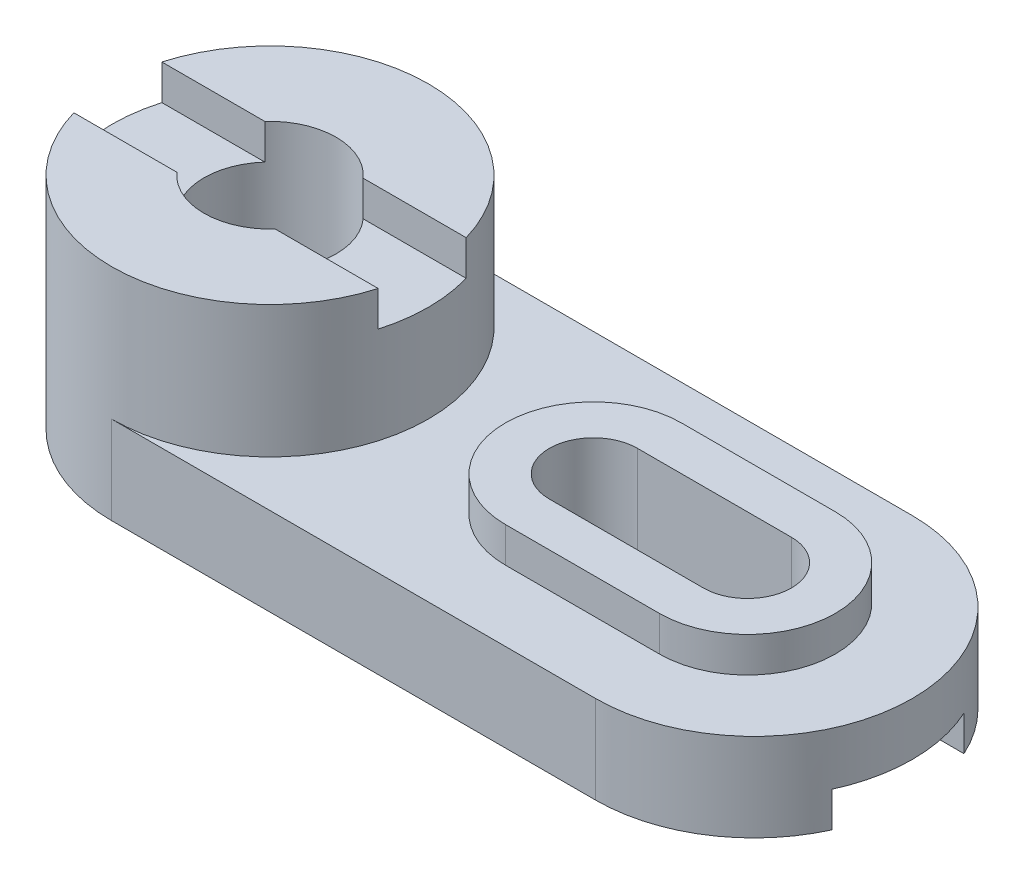
ISO-10303-21;
HEADER;
FILE_DESCRIPTION(('STEP AP214'),'2;1');
FILE_NAME('part.step','',(''),(''),'','','');
FILE_SCHEMA(('AUTOMOTIVE_DESIGN { 1 0 10303 214 1 1 1 1 }'));
ENDSEC;
DATA;
#1=APPLICATION_CONTEXT('core data for automotive mechanical design processes');
#2=APPLICATION_PROTOCOL_DEFINITION('international standard','automotive_design',2000,#1);
#3=PRODUCT_CONTEXT('',#1,'mechanical');
#4=PRODUCT('Part','Part','',(#3));
#5=PRODUCT_RELATED_PRODUCT_CATEGORY('part','',(#4));
#6=PRODUCT_DEFINITION_FORMATION('','',#4);
#7=PRODUCT_DEFINITION_CONTEXT('part definition',#1,'design');
#8=PRODUCT_DEFINITION('design','',#6,#7);
#9=PRODUCT_DEFINITION_SHAPE('','',#8);
#10=(LENGTH_UNIT() NAMED_UNIT(*) SI_UNIT(.MILLI.,.METRE.));
#11=(NAMED_UNIT(*) PLANE_ANGLE_UNIT() SI_UNIT($,.RADIAN.));
#12=(NAMED_UNIT(*) SI_UNIT($,.STERADIAN.) SOLID_ANGLE_UNIT());
#13=UNCERTAINTY_MEASURE_WITH_UNIT(LENGTH_MEASURE(1.E-05),#10,'distance_accuracy_value','');
#14=(GEOMETRIC_REPRESENTATION_CONTEXT(3) GLOBAL_UNCERTAINTY_ASSIGNED_CONTEXT((#13)) GLOBAL_UNIT_ASSIGNED_CONTEXT((#10,
#11,#12)) REPRESENTATION_CONTEXT('',''));
#15=CARTESIAN_POINT('',(0.,0.,0.));
#16=DIRECTION('',(0.,0.,1.));
#17=DIRECTION('',(1.,0.,0.));
#18=AXIS2_PLACEMENT_3D('',#15,#16,#17);
#19=CARTESIAN_POINT('',(18.5,28.,0.));
#20=DIRECTION('',(0.,1.,0.));
#21=DIRECTION('',(0.,0.,1.));
#22=AXIS2_PLACEMENT_3D('',#19,#20,#21);
#23=PLANE('',#22);
#24=CARTESIAN_POINT('',(18.5,28.,0.));
#25=DIRECTION('',(0.,1.,0.));
#26=DIRECTION('',(0.,0.,1.));
#27=AXIS2_PLACEMENT_3D('',#24,#25,#26);
#28=CIRCLE('',#27,20.);
#29=CARTESIAN_POINT('',(18.5,28.,-20.));
#30=VERTEX_POINT('',#29);
#31=CARTESIAN_POINT('',(18.5,28.,20.));
#32=VERTEX_POINT('',#31);
#33=EDGE_CURVE('E338',#30,#32,#28,.T.);
#34=ORIENTED_EDGE('',*,*,#33,.T.);
#35=DIRECTION('',(1.,0.,0.));
#36=VECTOR('',#35,1.);
#37=CARTESIAN_POINT('',(18.5,28.,20.));
#38=LINE('',#37,#36);
#39=CARTESIAN_POINT('',(53.5,28.,20.));
#40=VERTEX_POINT('',#39);
#41=EDGE_CURVE('E341',#32,#40,#38,.T.);
#42=ORIENTED_EDGE('',*,*,#41,.T.);
#43=CARTESIAN_POINT('',(53.5,28.,0.));
#44=DIRECTION('',(0.,1.,0.));
#45=DIRECTION('',(0.,0.,1.));
#46=AXIS2_PLACEMENT_3D('',#43,#44,#45);
#47=CIRCLE('',#46,20.);
#48=CARTESIAN_POINT('',(53.5,28.,-20.));
#49=VERTEX_POINT('',#48);
#50=EDGE_CURVE('E344',#40,#49,#47,.T.);
#51=ORIENTED_EDGE('',*,*,#50,.T.);
#52=DIRECTION('',(-1.,0.,0.));
#53=VECTOR('',#52,1.);
#54=CARTESIAN_POINT('',(18.5,28.,-20.));
#55=LINE('',#54,#53);
#56=EDGE_CURVE('E346',#49,#30,#55,.T.);
#57=ORIENTED_EDGE('',*,*,#56,.T.);
#58=EDGE_LOOP('',(#34,#42,#51,#57));
#59=FACE_BOUND('',#58,.T.);
#60=DIRECTION('',(-1.,0.,0.));
#61=VECTOR('',#60,1.);
#62=CARTESIAN_POINT('',(18.5,28.,10.));
#63=LINE('',#62,#61);
#64=CARTESIAN_POINT('',(53.5,28.,10.));
#65=VERTEX_POINT('',#64);
#66=CARTESIAN_POINT('',(18.5,28.,10.));
#67=VERTEX_POINT('',#66);
#68=EDGE_CURVE('E294',#65,#67,#63,.T.);
#69=ORIENTED_EDGE('',*,*,#68,.T.);
#70=CARTESIAN_POINT('',(18.5,28.,0.));
#71=DIRECTION('',(0.,1.,0.));
#72=DIRECTION('',(0.,0.,1.));
#73=AXIS2_PLACEMENT_3D('',#70,#71,#72);
#74=CIRCLE('',#73,10.);
#75=CARTESIAN_POINT('',(18.5,28.,-10.));
#76=VERTEX_POINT('',#75);
#77=EDGE_CURVE('E267',#67,#76,#74,.F.);
#78=ORIENTED_EDGE('',*,*,#77,.T.);
#79=DIRECTION('',(1.,0.,0.));
#80=VECTOR('',#79,1.);
#81=CARTESIAN_POINT('',(18.5,28.,-10.));
#82=LINE('',#81,#80);
#83=CARTESIAN_POINT('',(53.5,28.,-10.));
#84=VERTEX_POINT('',#83);
#85=EDGE_CURVE('E221',#76,#84,#82,.T.);
#86=ORIENTED_EDGE('',*,*,#85,.T.);
#87=CARTESIAN_POINT('',(53.5,28.,0.));
#88=DIRECTION('',(0.,1.,0.));
#89=DIRECTION('',(0.,0.,1.));
#90=AXIS2_PLACEMENT_3D('',#87,#88,#89);
#91=CIRCLE('',#90,10.);
#92=EDGE_CURVE('E276',#84,#65,#91,.F.);
#93=ORIENTED_EDGE('',*,*,#92,.T.);
#94=EDGE_LOOP('',(#69,#78,#86,#93));
#95=FACE_BOUND('',#94,.T.);
#96=ADVANCED_FACE('F36',(#59,#95),#23,.T.);
#97=CARTESIAN_POINT('',(-91.,42.,10.));
#98=DIRECTION('',(0.,-1.,0.));
#99=DIRECTION('',(0.,0.,-1.));
#100=AXIS2_PLACEMENT_3D('',#97,#98,#99);
#101=PLANE('',#100);
#102=CARTESIAN_POINT('',(-55.,42.,0.));
#103=DIRECTION('',(0.,-1.,0.));
#104=DIRECTION('',(0.,0.,-1.));
#105=AXIS2_PLACEMENT_3D('',#102,#103,#104);
#106=CIRCLE('',#105,15.);
#107=CARTESIAN_POINT('',(-66.1803398874989,42.,-10.));
#108=VERTEX_POINT('',#107);
#109=CARTESIAN_POINT('',(-66.180339887499,42.,10.));
#110=VERTEX_POINT('',#109);
#111=EDGE_CURVE('E287',#108,#110,#106,.F.);
#112=ORIENTED_EDGE('',*,*,#111,.F.);
#113=DIRECTION('',(1.,0.,0.));
#114=VECTOR('',#113,1.);
#115=CARTESIAN_POINT('',(-91.,42.,-10.));
#116=LINE('',#115,#114);
#117=CARTESIAN_POINT('',(-89.5832329315812,42.,-10.));
#118=VERTEX_POINT('',#117);
#119=EDGE_CURVE('E306',#118,#108,#116,.T.);
#120=ORIENTED_EDGE('',*,*,#119,.F.);
#121=CARTESIAN_POINT('',(-55.,42.,0.));
#122=DIRECTION('',(0.,-1.,0.));
#123=DIRECTION('',(0.,0.,-1.));
#124=AXIS2_PLACEMENT_3D('',#121,#122,#123);
#125=CIRCLE('',#124,36.);
#126=CARTESIAN_POINT('',(-89.5832329315812,42.,10.));
#127=VERTEX_POINT('',#126);
#128=EDGE_CURVE('E243',#127,#118,#125,.T.);
#129=ORIENTED_EDGE('',*,*,#128,.F.);
#130=DIRECTION('',(1.,0.,0.));
#131=VECTOR('',#130,1.);
#132=CARTESIAN_POINT('',(-91.,42.,10.));
#133=LINE('',#132,#131);
#134=EDGE_CURVE('E310',#127,#110,#133,.T.);
#135=ORIENTED_EDGE('',*,*,#134,.T.);
#136=EDGE_LOOP('',(#112,#120,#129,#135));
#137=FACE_BOUND('',#136,.T.);
#138=ADVANCED_FACE('F464',(#137),#101,.F.);
#139=CARTESIAN_POINT('',(-91.,50.,10.));
#140=DIRECTION('',(0.,0.,1.));
#141=DIRECTION('',(0.,-1.,0.));
#142=AXIS2_PLACEMENT_3D('',#139,#140,#141);
#143=PLANE('',#142);
#144=DIRECTION('',(0.,-1.,0.));
#145=VECTOR('',#144,1.);
#146=CARTESIAN_POINT('',(-66.180339887499,50.,10.));
#147=LINE('',#146,#145);
#148=CARTESIAN_POINT('',(-66.180339887499,50.,10.));
#149=VERTEX_POINT('',#148);
#150=EDGE_CURVE('E207',#110,#149,#147,.F.);
#151=ORIENTED_EDGE('',*,*,#150,.F.);
#152=ORIENTED_EDGE('',*,*,#134,.F.);
#153=DIRECTION('',(0.,-1.,0.));
#154=VECTOR('',#153,1.);
#155=CARTESIAN_POINT('',(-89.5832329315812,20.,9.99999999999999));
#156=LINE('',#155,#154);
#157=CARTESIAN_POINT('',(-89.5832329315811,50.,10.));
#158=VERTEX_POINT('',#157);
#159=EDGE_CURVE('E320',#158,#127,#156,.T.);
#160=ORIENTED_EDGE('',*,*,#159,.F.);
#161=DIRECTION('',(1.,0.,0.));
#162=VECTOR('',#161,1.);
#163=CARTESIAN_POINT('',(-55.,50.,10.));
#164=LINE('',#163,#162);
#165=EDGE_CURVE('E228',#158,#149,#164,.T.);
#166=ORIENTED_EDGE('',*,*,#165,.T.);
#167=EDGE_LOOP('',(#151,#152,#160,#166));
#168=FACE_BOUND('',#167,.T.);
#169=ADVANCED_FACE('F470',(#168),#143,.F.);
#170=DIRECTION('',(0.,-1.,0.));
#171=VECTOR('',#170,1.);
#172=CARTESIAN_POINT('',(-43.819660112501,50.,10.));
#173=LINE('',#172,#171);
#174=CARTESIAN_POINT('',(-43.819660112501,50.,10.));
#175=VERTEX_POINT('',#174);
#176=CARTESIAN_POINT('',(-43.819660112501,42.,10.));
#177=VERTEX_POINT('',#176);
#178=EDGE_CURVE('E204',#175,#177,#173,.T.);
#179=ORIENTED_EDGE('',*,*,#178,.F.);
#180=CARTESIAN_POINT('',(-20.4167670684188,50.,10.));
#181=VERTEX_POINT('',#180);
#182=EDGE_CURVE('E218',#175,#181,#164,.T.);
#183=ORIENTED_EDGE('',*,*,#182,.T.);
#184=DIRECTION('',(0.,-1.,0.));
#185=VECTOR('',#184,1.);
#186=CARTESIAN_POINT('',(-20.4167670684188,20.,9.99999999999999));
#187=LINE('',#186,#185);
#188=CARTESIAN_POINT('',(-20.4167670684188,42.,10.));
#189=VERTEX_POINT('',#188);
#190=EDGE_CURVE('E318',#189,#181,#187,.F.);
#191=ORIENTED_EDGE('',*,*,#190,.F.);
#192=EDGE_CURVE('E220',#177,#189,#133,.T.);
#193=ORIENTED_EDGE('',*,*,#192,.F.);
#194=EDGE_LOOP('',(#179,#183,#191,#193));
#195=FACE_BOUND('',#194,.T.);
#196=ADVANCED_FACE('F216',(#195),#143,.F.);
#197=CARTESIAN_POINT('',(-91.,50.,-10.));
#198=DIRECTION('',(0.,0.,-1.));
#199=DIRECTION('',(0.,1.,0.));
#200=AXIS2_PLACEMENT_3D('',#197,#198,#199);
#201=PLANE('',#200);
#202=DIRECTION('',(0.,-1.,0.));
#203=VECTOR('',#202,1.);
#204=CARTESIAN_POINT('',(-43.8196601125011,50.,-10.));
#205=LINE('',#204,#203);
#206=CARTESIAN_POINT('',(-43.8196601125011,42.,-10.));
#207=VERTEX_POINT('',#206);
#208=CARTESIAN_POINT('',(-43.8196601125011,50.,-10.));
#209=VERTEX_POINT('',#208);
#210=EDGE_CURVE('E290',#207,#209,#205,.F.);
#211=ORIENTED_EDGE('',*,*,#210,.F.);
#212=CARTESIAN_POINT('',(-20.4167670684188,42.,-10.));
#213=VERTEX_POINT('',#212);
#214=EDGE_CURVE('E309',#207,#213,#116,.T.);
#215=ORIENTED_EDGE('',*,*,#214,.T.);
#216=DIRECTION('',(0.,-1.,0.));
#217=VECTOR('',#216,1.);
#218=CARTESIAN_POINT('',(-20.4167670684188,20.,-9.99999999999999));
#219=LINE('',#218,#217);
#220=CARTESIAN_POINT('',(-20.4167670684188,50.,-10.));
#221=VERTEX_POINT('',#220);
#222=EDGE_CURVE('E315',#221,#213,#219,.T.);
#223=ORIENTED_EDGE('',*,*,#222,.F.);
#224=DIRECTION('',(-1.,0.,0.));
#225=VECTOR('',#224,1.);
#226=CARTESIAN_POINT('',(-55.,50.,-10.));
#227=LINE('',#226,#225);
#228=EDGE_CURVE('E229',#221,#209,#227,.T.);
#229=ORIENTED_EDGE('',*,*,#228,.T.);
#230=EDGE_LOOP('',(#211,#215,#223,#229));
#231=FACE_BOUND('',#230,.T.);
#232=ADVANCED_FACE('F517',(#231),#201,.F.);
#233=DIRECTION('',(0.,-1.,0.));
#234=VECTOR('',#233,1.);
#235=CARTESIAN_POINT('',(-66.1803398874989,50.,-10.));
#236=LINE('',#235,#234);
#237=CARTESIAN_POINT('',(-66.1803398874989,50.,-10.));
#238=VERTEX_POINT('',#237);
#239=EDGE_CURVE('E285',#238,#108,#236,.T.);
#240=ORIENTED_EDGE('',*,*,#239,.F.);
#241=CARTESIAN_POINT('',(-89.5832329315811,50.,-10.));
#242=VERTEX_POINT('',#241);
#243=EDGE_CURVE('E233',#238,#242,#227,.T.);
#244=ORIENTED_EDGE('',*,*,#243,.T.);
#245=DIRECTION('',(0.,-1.,0.));
#246=VECTOR('',#245,1.);
#247=CARTESIAN_POINT('',(-89.5832329315812,20.,-9.99999999999999));
#248=LINE('',#247,#246);
#249=EDGE_CURVE('E300',#118,#242,#248,.F.);
#250=ORIENTED_EDGE('',*,*,#249,.F.);
#251=ORIENTED_EDGE('',*,*,#119,.T.);
#252=EDGE_LOOP('',(#240,#244,#250,#251));
#253=FACE_BOUND('',#252,.T.);
#254=ADVANCED_FACE('F403',(#253),#201,.F.);
#255=CARTESIAN_POINT('',(-91.,8.,15.));
#256=DIRECTION('',(0.,1.,0.));
#257=DIRECTION('',(0.,0.,1.));
#258=AXIS2_PLACEMENT_3D('',#255,#256,#257);
#259=PLANE('',#258);
#260=CARTESIAN_POINT('',(-55.,8.,0.));
#261=DIRECTION('',(0.,1.,0.));
#262=DIRECTION('',(0.,0.,1.));
#263=AXIS2_PLACEMENT_3D('',#260,#261,#262);
#264=CIRCLE('',#263,15.);
#265=CARTESIAN_POINT('',(-55.,8.,15.));
#266=VERTEX_POINT('',#265);
#267=CARTESIAN_POINT('',(-55.,8.00000000000001,-15.));
#268=VERTEX_POINT('',#267);
#269=EDGE_CURVE('E284',#266,#268,#264,.F.);
#270=ORIENTED_EDGE('',*,*,#269,.F.);
#271=DIRECTION('',(1.,0.,0.));
#272=VECTOR('',#271,1.);
#273=CARTESIAN_POINT('',(-91.,8.,15.));
#274=LINE('',#273,#272);
#275=CARTESIAN_POINT('',(-87.7261363439071,8.,15.));
#276=VERTEX_POINT('',#275);
#277=EDGE_CURVE('E297',#276,#266,#274,.T.);
#278=ORIENTED_EDGE('',*,*,#277,.F.);
#279=CARTESIAN_POINT('',(-55.,8.,0.));
#280=DIRECTION('',(0.,1.,0.));
#281=DIRECTION('',(0.,0.,1.));
#282=AXIS2_PLACEMENT_3D('',#279,#280,#281);
#283=CIRCLE('',#282,36.);
#284=CARTESIAN_POINT('',(-87.7261363439071,8.00000000000001,-15.));
#285=VERTEX_POINT('',#284);
#286=EDGE_CURVE('E335',#285,#276,#283,.T.);
#287=ORIENTED_EDGE('',*,*,#286,.F.);
#288=DIRECTION('',(1.,0.,0.));
#289=VECTOR('',#288,1.);
#290=CARTESIAN_POINT('',(-91.,8.00000000000001,-15.));
#291=LINE('',#290,#289);
#292=EDGE_CURVE('E302',#285,#268,#291,.T.);
#293=ORIENTED_EDGE('',*,*,#292,.T.);
#294=EDGE_LOOP('',(#270,#278,#287,#293));
#295=FACE_BOUND('',#294,.T.);
#296=ADVANCED_FACE('F449',(#295),#259,.F.);
#297=CARTESIAN_POINT('',(18.5,8.,0.));
#298=DIRECTION('',(0.,1.,0.));
#299=DIRECTION('',(0.,0.,1.));
#300=AXIS2_PLACEMENT_3D('',#297,#298,#299);
#301=CIRCLE('',#300,10.);
#302=CARTESIAN_POINT('',(18.5,8.,10.));
#303=VERTEX_POINT('',#302);
#304=CARTESIAN_POINT('',(18.5,8.,-10.));
#305=VERTEX_POINT('',#304);
#306=EDGE_CURVE('E11',#303,#305,#301,.F.);
#307=ORIENTED_EDGE('',*,*,#306,.F.);
#308=DIRECTION('',(-1.,0.,0.));
#309=VECTOR('',#308,1.);
#310=CARTESIAN_POINT('',(-91.,8.,10.));
#311=LINE('',#310,#309);
#312=CARTESIAN_POINT('',(53.5,8.,10.));
#313=VERTEX_POINT('',#312);
#314=EDGE_CURVE('E44',#313,#303,#311,.T.);
#315=ORIENTED_EDGE('',*,*,#314,.F.);
#316=CARTESIAN_POINT('',(53.5,8.,0.));
#317=DIRECTION('',(0.,1.,0.));
#318=DIRECTION('',(0.,0.,1.));
#319=AXIS2_PLACEMENT_3D('',#316,#317,#318);
#320=CIRCLE('',#319,10.);
#321=CARTESIAN_POINT('',(53.5,8.00000000000001,-10.));
#322=VERTEX_POINT('',#321);
#323=EDGE_CURVE('E249',#322,#313,#320,.F.);
#324=ORIENTED_EDGE('',*,*,#323,.F.);
#325=DIRECTION('',(1.,0.,0.));
#326=VECTOR('',#325,1.);
#327=CARTESIAN_POINT('',(-91.,8.,-9.99999999999998));
#328=LINE('',#327,#326);
#329=EDGE_CURVE('E247',#305,#322,#328,.T.);
#330=ORIENTED_EDGE('',*,*,#329,.F.);
#331=EDGE_LOOP('',(#307,#315,#324,#330));
#332=FACE_BOUND('',#331,.T.);
#333=EDGE_CURVE('E282',#268,#266,#264,.F.);
#334=ORIENTED_EDGE('',*,*,#333,.F.);
#335=CARTESIAN_POINT('',(87.7261363439071,8.00000000000001,-15.));
#336=VERTEX_POINT('',#335);
#337=EDGE_CURVE('E305',#268,#336,#291,.T.);
#338=ORIENTED_EDGE('',*,*,#337,.T.);
#339=CARTESIAN_POINT('',(55.,8.,0.));
#340=DIRECTION('',(0.,1.,0.));
#341=DIRECTION('',(0.,0.,1.));
#342=AXIS2_PLACEMENT_3D('',#339,#340,#341);
#343=CIRCLE('',#342,36.);
#344=CARTESIAN_POINT('',(87.7261363439071,8.,15.));
#345=VERTEX_POINT('',#344);
#346=EDGE_CURVE('E240',#345,#336,#343,.T.);
#347=ORIENTED_EDGE('',*,*,#346,.F.);
#348=EDGE_CURVE('E301',#266,#345,#274,.T.);
#349=ORIENTED_EDGE('',*,*,#348,.F.);
#350=EDGE_LOOP('',(#334,#338,#347,#349));
#351=FACE_BOUND('',#350,.T.);
#352=ADVANCED_FACE('F269',(#332,#351),#259,.F.);
#353=CARTESIAN_POINT('',(-55.,0.,0.));
#354=DIRECTION('',(0.,1.,0.));
#355=DIRECTION('',(0.,0.,1.));
#356=AXIS2_PLACEMENT_3D('',#353,#354,#355);
#357=PLANE('',#356);
#358=CARTESIAN_POINT('',(-55.,0.,0.));
#359=DIRECTION('',(0.,1.,0.));
#360=DIRECTION('',(0.,0.,1.));
#361=AXIS2_PLACEMENT_3D('',#358,#359,#360);
#362=CIRCLE('',#361,36.);
#363=CARTESIAN_POINT('',(-87.7261363439071,0.,15.));
#364=VERTEX_POINT('',#363);
#365=CARTESIAN_POINT('',(-55.,0.,36.));
#366=VERTEX_POINT('',#365);
#367=EDGE_CURVE('E383',#364,#366,#362,.T.);
#368=ORIENTED_EDGE('',*,*,#367,.F.);
#369=DIRECTION('',(1.,0.,0.));
#370=VECTOR('',#369,1.);
#371=CARTESIAN_POINT('',(-55.,0.,15.));
#372=LINE('',#371,#370);
#373=CARTESIAN_POINT('',(87.7261363439071,0.,15.));
#374=VERTEX_POINT('',#373);
#375=EDGE_CURVE('E238',#364,#374,#372,.T.);
#376=ORIENTED_EDGE('',*,*,#375,.T.);
#377=CARTESIAN_POINT('',(55.,0.,0.));
#378=DIRECTION('',(0.,1.,0.));
#379=DIRECTION('',(0.,0.,1.));
#380=AXIS2_PLACEMENT_3D('',#377,#378,#379);
#381=CIRCLE('',#380,36.);
#382=CARTESIAN_POINT('',(55.,0.,36.));
#383=VERTEX_POINT('',#382);
#384=EDGE_CURVE('E386',#383,#374,#381,.T.);
#385=ORIENTED_EDGE('',*,*,#384,.F.);
#386=DIRECTION('',(1.,0.,0.));
#387=VECTOR('',#386,1.);
#388=CARTESIAN_POINT('',(-55.,0.,36.));
#389=LINE('',#388,#387);
#390=EDGE_CURVE('E382',#366,#383,#389,.T.);
#391=ORIENTED_EDGE('',*,*,#390,.F.);
#392=EDGE_LOOP('',(#368,#376,#385,#391));
#393=FACE_BOUND('',#392,.T.);
#394=ADVANCED_FACE('F418',(#393),#357,.F.);
#395=CARTESIAN_POINT('',(-55.,50.,0.));
#396=DIRECTION('',(0.,1.,0.));
#397=DIRECTION('',(0.,0.,1.));
#398=AXIS2_PLACEMENT_3D('',#395,#396,#397);
#399=PLANE('',#398);
#400=ORIENTED_EDGE('',*,*,#182,.F.);
#401=CARTESIAN_POINT('',(-55.,50.,0.));
#402=DIRECTION('',(0.,1.,0.));
#403=DIRECTION('',(0.,0.,1.));
#404=AXIS2_PLACEMENT_3D('',#401,#402,#403);
#405=CIRCLE('',#404,15.);
#406=EDGE_CURVE('E201',#149,#175,#405,.T.);
#407=ORIENTED_EDGE('',*,*,#406,.F.);
#408=ORIENTED_EDGE('',*,*,#165,.F.);
#409=CARTESIAN_POINT('',(-55.,50.,0.));
#410=DIRECTION('',(0.,1.,0.));
#411=DIRECTION('',(0.,0.,1.));
#412=AXIS2_PLACEMENT_3D('',#409,#410,#411);
#413=CIRCLE('',#412,36.);
#414=EDGE_CURVE('E227',#158,#181,#413,.T.);
#415=ORIENTED_EDGE('',*,*,#414,.T.);
#416=EDGE_LOOP('',(#400,#407,#408,#415));
#417=FACE_BOUND('',#416,.T.);
#418=ADVANCED_FACE('F225',(#417),#399,.T.);
#419=CARTESIAN_POINT('',(-55.,20.,0.));
#420=DIRECTION('',(0.,1.,0.));
#421=DIRECTION('',(0.,0.,1.));
#422=AXIS2_PLACEMENT_3D('',#419,#420,#421);
#423=PLANE('',#422);
#424=CARTESIAN_POINT('',(-55.,20.,0.));
#425=DIRECTION('',(0.,1.,0.));
#426=DIRECTION('',(0.,0.,1.));
#427=AXIS2_PLACEMENT_3D('',#424,#425,#426);
#428=CIRCLE('',#427,36.);
#429=CARTESIAN_POINT('',(-55.,20.,36.));
#430=VERTEX_POINT('',#429);
#431=CARTESIAN_POINT('',(-55.,20.,-36.));
#432=VERTEX_POINT('',#431);
#433=EDGE_CURVE('E366',#430,#432,#428,.T.);
#434=ORIENTED_EDGE('',*,*,#433,.F.);
#435=DIRECTION('',(1.,0.,0.));
#436=VECTOR('',#435,1.);
#437=CARTESIAN_POINT('',(-55.,20.,36.));
#438=LINE('',#437,#436);
#439=CARTESIAN_POINT('',(55.,20.,36.));
#440=VERTEX_POINT('',#439);
#441=EDGE_CURVE('E371',#430,#440,#438,.T.);
#442=ORIENTED_EDGE('',*,*,#441,.T.);
#443=CARTESIAN_POINT('',(55.,20.,0.));
#444=DIRECTION('',(0.,1.,0.));
#445=DIRECTION('',(0.,0.,1.));
#446=AXIS2_PLACEMENT_3D('',#443,#444,#445);
#447=CIRCLE('',#446,36.);
#448=CARTESIAN_POINT('',(55.,20.,-36.));
#449=VERTEX_POINT('',#448);
#450=EDGE_CURVE('E373',#440,#449,#447,.T.);
#451=ORIENTED_EDGE('',*,*,#450,.T.);
#452=DIRECTION('',(-1.,0.,0.));
#453=VECTOR('',#452,1.);
#454=CARTESIAN_POINT('',(-55.,20.,-36.));
#455=LINE('',#454,#453);
#456=EDGE_CURVE('E376',#449,#432,#455,.T.);
#457=ORIENTED_EDGE('',*,*,#456,.T.);
#458=EDGE_LOOP('',(#434,#442,#451,#457));
#459=FACE_BOUND('',#458,.T.);
#460=DIRECTION('',(1.,0.,0.));
#461=VECTOR('',#460,1.);
#462=CARTESIAN_POINT('',(18.5,20.,20.));
#463=LINE('',#462,#461);
#464=CARTESIAN_POINT('',(18.5,20.,20.));
#465=VERTEX_POINT('',#464);
#466=CARTESIAN_POINT('',(53.5,20.,20.));
#467=VERTEX_POINT('',#466);
#468=EDGE_CURVE('E351',#465,#467,#463,.T.);
#469=ORIENTED_EDGE('',*,*,#468,.F.);
#470=CARTESIAN_POINT('',(18.5,20.,0.));
#471=DIRECTION('',(0.,1.,0.));
#472=DIRECTION('',(0.,0.,1.));
#473=AXIS2_PLACEMENT_3D('',#470,#471,#472);
#474=CIRCLE('',#473,20.);
#475=CARTESIAN_POINT('',(18.5,20.,-20.));
#476=VERTEX_POINT('',#475);
#477=EDGE_CURVE('E337',#476,#465,#474,.T.);
#478=ORIENTED_EDGE('',*,*,#477,.F.);
#479=DIRECTION('',(-1.,0.,0.));
#480=VECTOR('',#479,1.);
#481=CARTESIAN_POINT('',(18.5,20.,-20.));
#482=LINE('',#481,#480);
#483=CARTESIAN_POINT('',(53.5,20.,-20.));
#484=VERTEX_POINT('',#483);
#485=EDGE_CURVE('E342',#484,#476,#482,.T.);
#486=ORIENTED_EDGE('',*,*,#485,.F.);
#487=CARTESIAN_POINT('',(53.5,20.,0.));
#488=DIRECTION('',(0.,1.,0.));
#489=DIRECTION('',(0.,0.,1.));
#490=AXIS2_PLACEMENT_3D('',#487,#488,#489);
#491=CIRCLE('',#490,20.);
#492=EDGE_CURVE('E353',#467,#484,#491,.T.);
#493=ORIENTED_EDGE('',*,*,#492,.F.);
#494=EDGE_LOOP('',(#469,#478,#486,#493));
#495=FACE_BOUND('',#494,.T.);
#496=ADVANCED_FACE('F428',(#459,#495),#423,.T.);
#497=CARTESIAN_POINT('',(-55.,20.,0.));
#498=DIRECTION('',(0.,-1.,0.));
#499=DIRECTION('',(0.,0.,-1.));
#500=AXIS2_PLACEMENT_3D('',#497,#498,#499);
#501=CYLINDRICAL_SURFACE('',#500,36.);
#502=DIRECTION('',(0.,-1.,0.));
#503=VECTOR('',#502,1.);
#504=CARTESIAN_POINT('',(-87.7261363439071,20.,-15.));
#505=LINE('',#504,#503);
#506=CARTESIAN_POINT('',(-87.7261363439071,0.,-15.));
#507=VERTEX_POINT('',#506);
#508=EDGE_CURVE('E326',#507,#285,#505,.F.);
#509=ORIENTED_EDGE('',*,*,#508,.T.);
#510=ORIENTED_EDGE('',*,*,#286,.T.);
#511=DIRECTION('',(0.,-1.,0.));
#512=VECTOR('',#511,1.);
#513=CARTESIAN_POINT('',(-87.7261363439071,20.,15.));
#514=LINE('',#513,#512);
#515=EDGE_CURVE('E332',#276,#364,#514,.T.);
#516=ORIENTED_EDGE('',*,*,#515,.T.);
#517=ORIENTED_EDGE('',*,*,#367,.T.);
#518=DIRECTION('',(0.,-1.,0.));
#519=VECTOR('',#518,1.);
#520=CARTESIAN_POINT('',(-55.,20.,36.));
#521=LINE('',#520,#519);
#522=EDGE_CURVE('E397',#430,#366,#521,.T.);
#523=ORIENTED_EDGE('',*,*,#522,.F.);
#524=ORIENTED_EDGE('',*,*,#433,.T.);
#525=DIRECTION('',(0.,-1.,0.));
#526=VECTOR('',#525,1.);
#527=CARTESIAN_POINT('',(-55.,20.,-36.));
#528=LINE('',#527,#526);
#529=CARTESIAN_POINT('',(-55.,0.,-36.));
#530=VERTEX_POINT('',#529);
#531=EDGE_CURVE('E378',#432,#530,#528,.T.);
#532=ORIENTED_EDGE('',*,*,#531,.T.);
#533=EDGE_CURVE('E379',#530,#507,#362,.T.);
#534=ORIENTED_EDGE('',*,*,#533,.T.);
#535=EDGE_LOOP('',(#509,#510,#516,#517,#523,#524,#532,#534));
#536=FACE_BOUND('',#535,.T.);
#537=EDGE_CURVE('E246',#213,#189,#125,.T.);
#538=ORIENTED_EDGE('',*,*,#537,.T.);
#539=ORIENTED_EDGE('',*,*,#190,.T.);
#540=ORIENTED_EDGE('',*,*,#414,.F.);
#541=ORIENTED_EDGE('',*,*,#159,.T.);
#542=ORIENTED_EDGE('',*,*,#128,.T.);
#543=ORIENTED_EDGE('',*,*,#249,.T.);
#544=EDGE_CURVE('E368',#221,#242,#413,.T.);
#545=ORIENTED_EDGE('',*,*,#544,.F.);
#546=ORIENTED_EDGE('',*,*,#222,.T.);
#547=EDGE_LOOP('',(#538,#539,#540,#541,#542,#543,#545,#546));
#548=FACE_BOUND('',#547,.T.);
#549=ADVANCED_FACE('F38',(#536,#548),#501,.T.);
#550=CARTESIAN_POINT('',(-55.,20.,36.));
#551=DIRECTION('',(0.,0.,-1.));
#552=DIRECTION('',(-1.,0.,0.));
#553=AXIS2_PLACEMENT_3D('',#550,#551,#552);
#554=PLANE('',#553);
#555=ORIENTED_EDGE('',*,*,#390,.T.);
#556=DIRECTION('',(0.,-1.,0.));
#557=VECTOR('',#556,1.);
#558=CARTESIAN_POINT('',(55.,20.,36.));
#559=LINE('',#558,#557);
#560=EDGE_CURVE('E395',#440,#383,#559,.T.);
#561=ORIENTED_EDGE('',*,*,#560,.F.);
#562=ORIENTED_EDGE('',*,*,#441,.F.);
#563=ORIENTED_EDGE('',*,*,#522,.T.);
#564=EDGE_LOOP('',(#555,#561,#562,#563));
#565=FACE_BOUND('',#564,.T.);
#566=ADVANCED_FACE('F420',(#565),#554,.F.);
#567=CARTESIAN_POINT('',(55.,20.,0.));
#568=DIRECTION('',(0.,-1.,0.));
#569=DIRECTION('',(0.,0.,-1.));
#570=AXIS2_PLACEMENT_3D('',#567,#568,#569);
#571=CYLINDRICAL_SURFACE('',#570,36.);
#572=ORIENTED_EDGE('',*,*,#384,.T.);
#573=DIRECTION('',(0.,-1.,0.));
#574=VECTOR('',#573,1.);
#575=CARTESIAN_POINT('',(87.7261363439071,20.,15.));
#576=LINE('',#575,#574);
#577=EDGE_CURVE('E329',#374,#345,#576,.F.);
#578=ORIENTED_EDGE('',*,*,#577,.T.);
#579=ORIENTED_EDGE('',*,*,#346,.T.);
#580=DIRECTION('',(0.,-1.,0.));
#581=VECTOR('',#580,1.);
#582=CARTESIAN_POINT('',(87.7261363439071,20.,-15.));
#583=LINE('',#582,#581);
#584=CARTESIAN_POINT('',(87.7261363439071,0.,-15.));
#585=VERTEX_POINT('',#584);
#586=EDGE_CURVE('E323',#336,#585,#583,.T.);
#587=ORIENTED_EDGE('',*,*,#586,.T.);
#588=CARTESIAN_POINT('',(55.,0.,-36.));
#589=VERTEX_POINT('',#588);
#590=EDGE_CURVE('E385',#585,#589,#381,.T.);
#591=ORIENTED_EDGE('',*,*,#590,.T.);
#592=DIRECTION('',(0.,-1.,0.));
#593=VECTOR('',#592,1.);
#594=CARTESIAN_POINT('',(55.,20.,-36.));
#595=LINE('',#594,#593);
#596=EDGE_CURVE('E392',#449,#589,#595,.T.);
#597=ORIENTED_EDGE('',*,*,#596,.F.);
#598=ORIENTED_EDGE('',*,*,#450,.F.);
#599=ORIENTED_EDGE('',*,*,#560,.T.);
#600=EDGE_LOOP('',(#572,#578,#579,#587,#591,#597,#598,#599));
#601=FACE_BOUND('',#600,.T.);
#602=ADVANCED_FACE('F423',(#601),#571,.T.);
#603=CARTESIAN_POINT('',(-55.,20.,-36.));
#604=DIRECTION('',(0.,0.,1.));
#605=DIRECTION('',(1.,0.,0.));
#606=AXIS2_PLACEMENT_3D('',#603,#604,#605);
#607=PLANE('',#606);
#608=DIRECTION('',(-1.,0.,0.));
#609=VECTOR('',#608,1.);
#610=CARTESIAN_POINT('',(-55.,0.,-36.));
#611=LINE('',#610,#609);
#612=EDGE_CURVE('E374',#589,#530,#611,.T.);
#613=ORIENTED_EDGE('',*,*,#612,.T.);
#614=ORIENTED_EDGE('',*,*,#531,.F.);
#615=ORIENTED_EDGE('',*,*,#456,.F.);
#616=ORIENTED_EDGE('',*,*,#596,.T.);
#617=EDGE_LOOP('',(#613,#614,#615,#616));
#618=FACE_BOUND('',#617,.T.);
#619=ADVANCED_FACE('F454',(#618),#607,.F.);
#620=ORIENTED_EDGE('',*,*,#590,.F.);
#621=DIRECTION('',(-1.,0.,0.));
#622=VECTOR('',#621,1.);
#623=CARTESIAN_POINT('',(-55.,0.,-15.));
#624=LINE('',#623,#622);
#625=EDGE_CURVE('E231',#585,#507,#624,.T.);
#626=ORIENTED_EDGE('',*,*,#625,.T.);
#627=ORIENTED_EDGE('',*,*,#533,.F.);
#628=ORIENTED_EDGE('',*,*,#612,.F.);
#629=EDGE_LOOP('',(#620,#626,#627,#628));
#630=FACE_BOUND('',#629,.T.);
#631=ADVANCED_FACE('F436',(#630),#357,.F.);
#632=ORIENTED_EDGE('',*,*,#243,.F.);
#633=EDGE_CURVE('E59',#209,#238,#405,.T.);
#634=ORIENTED_EDGE('',*,*,#633,.F.);
#635=ORIENTED_EDGE('',*,*,#228,.F.);
#636=ORIENTED_EDGE('',*,*,#544,.T.);
#637=EDGE_LOOP('',(#632,#634,#635,#636));
#638=FACE_BOUND('',#637,.T.);
#639=ADVANCED_FACE('F411',(#638),#399,.T.);
#640=CARTESIAN_POINT('',(18.5,28.,0.));
#641=DIRECTION('',(0.,-1.,0.));
#642=DIRECTION('',(0.,0.,-1.));
#643=AXIS2_PLACEMENT_3D('',#640,#641,#642);
#644=CYLINDRICAL_SURFACE('',#643,20.);
#645=ORIENTED_EDGE('',*,*,#477,.T.);
#646=DIRECTION('',(0.,-1.,0.));
#647=VECTOR('',#646,1.);
#648=CARTESIAN_POINT('',(18.5,28.,20.));
#649=LINE('',#648,#647);
#650=EDGE_CURVE('E364',#32,#465,#649,.T.);
#651=ORIENTED_EDGE('',*,*,#650,.F.);
#652=ORIENTED_EDGE('',*,*,#33,.F.);
#653=DIRECTION('',(0.,-1.,0.));
#654=VECTOR('',#653,1.);
#655=CARTESIAN_POINT('',(18.5,28.,-20.));
#656=LINE('',#655,#654);
#657=EDGE_CURVE('E348',#30,#476,#656,.T.);
#658=ORIENTED_EDGE('',*,*,#657,.T.);
#659=EDGE_LOOP('',(#645,#651,#652,#658));
#660=FACE_BOUND('',#659,.T.);
#661=ADVANCED_FACE('F488',(#660),#644,.T.);
#662=CARTESIAN_POINT('',(18.5,28.,20.));
#663=DIRECTION('',(0.,0.,-1.));
#664=DIRECTION('',(-1.,0.,0.));
#665=AXIS2_PLACEMENT_3D('',#662,#663,#664);
#666=PLANE('',#665);
#667=ORIENTED_EDGE('',*,*,#468,.T.);
#668=DIRECTION('',(0.,-1.,0.));
#669=VECTOR('',#668,1.);
#670=CARTESIAN_POINT('',(53.5,28.,20.));
#671=LINE('',#670,#669);
#672=EDGE_CURVE('E361',#40,#467,#671,.T.);
#673=ORIENTED_EDGE('',*,*,#672,.F.);
#674=ORIENTED_EDGE('',*,*,#41,.F.);
#675=ORIENTED_EDGE('',*,*,#650,.T.);
#676=EDGE_LOOP('',(#667,#673,#674,#675));
#677=FACE_BOUND('',#676,.T.);
#678=ADVANCED_FACE('F484',(#677),#666,.F.);
#679=CARTESIAN_POINT('',(53.5,28.,0.));
#680=DIRECTION('',(0.,-1.,0.));
#681=DIRECTION('',(0.,0.,-1.));
#682=AXIS2_PLACEMENT_3D('',#679,#680,#681);
#683=CYLINDRICAL_SURFACE('',#682,20.);
#684=ORIENTED_EDGE('',*,*,#492,.T.);
#685=DIRECTION('',(0.,-1.,0.));
#686=VECTOR('',#685,1.);
#687=CARTESIAN_POINT('',(53.5,28.,-20.));
#688=LINE('',#687,#686);
#689=EDGE_CURVE('E359',#49,#484,#688,.T.);
#690=ORIENTED_EDGE('',*,*,#689,.F.);
#691=ORIENTED_EDGE('',*,*,#50,.F.);
#692=ORIENTED_EDGE('',*,*,#672,.T.);
#693=EDGE_LOOP('',(#684,#690,#691,#692));
#694=FACE_BOUND('',#693,.T.);
#695=ADVANCED_FACE('F480',(#694),#683,.T.);
#696=CARTESIAN_POINT('',(18.5,28.,-20.));
#697=DIRECTION('',(0.,0.,1.));
#698=DIRECTION('',(1.,0.,0.));
#699=AXIS2_PLACEMENT_3D('',#696,#697,#698);
#700=PLANE('',#699);
#701=ORIENTED_EDGE('',*,*,#485,.T.);
#702=ORIENTED_EDGE('',*,*,#657,.F.);
#703=ORIENTED_EDGE('',*,*,#56,.F.);
#704=ORIENTED_EDGE('',*,*,#689,.T.);
#705=EDGE_LOOP('',(#701,#702,#703,#704));
#706=FACE_BOUND('',#705,.T.);
#707=ADVANCED_FACE('F477',(#706),#700,.F.);
#708=EDGE_CURVE('E222',#177,#207,#106,.F.);
#709=ORIENTED_EDGE('',*,*,#708,.F.);
#710=ORIENTED_EDGE('',*,*,#192,.T.);
#711=ORIENTED_EDGE('',*,*,#537,.F.);
#712=ORIENTED_EDGE('',*,*,#214,.F.);
#713=EDGE_LOOP('',(#709,#710,#711,#712));
#714=FACE_BOUND('',#713,.T.);
#715=ADVANCED_FACE('F473',(#714),#101,.F.);
#716=CARTESIAN_POINT('',(-91.,0.,15.));
#717=DIRECTION('',(0.,0.,1.));
#718=DIRECTION('',(1.,0.,0.));
#719=AXIS2_PLACEMENT_3D('',#716,#717,#718);
#720=PLANE('',#719);
#721=ORIENTED_EDGE('',*,*,#577,.F.);
#722=ORIENTED_EDGE('',*,*,#375,.F.);
#723=ORIENTED_EDGE('',*,*,#515,.F.);
#724=ORIENTED_EDGE('',*,*,#277,.T.);
#725=ORIENTED_EDGE('',*,*,#348,.T.);
#726=EDGE_LOOP('',(#721,#722,#723,#724,#725));
#727=FACE_BOUND('',#726,.T.);
#728=ADVANCED_FACE('F447',(#727),#720,.F.);
#729=CARTESIAN_POINT('',(-91.,0.,-15.));
#730=DIRECTION('',(0.,0.,-1.));
#731=DIRECTION('',(0.,1.,0.));
#732=AXIS2_PLACEMENT_3D('',#729,#730,#731);
#733=PLANE('',#732);
#734=ORIENTED_EDGE('',*,*,#508,.F.);
#735=ORIENTED_EDGE('',*,*,#625,.F.);
#736=ORIENTED_EDGE('',*,*,#586,.F.);
#737=ORIENTED_EDGE('',*,*,#337,.F.);
#738=ORIENTED_EDGE('',*,*,#292,.F.);
#739=EDGE_LOOP('',(#734,#735,#736,#737,#738));
#740=FACE_BOUND('',#739,.T.);
#741=ADVANCED_FACE('F441',(#740),#733,.F.);
#742=CARTESIAN_POINT('',(18.5,50.,0.));
#743=DIRECTION('',(0.,-1.,0.));
#744=DIRECTION('',(0.,0.,-1.));
#745=AXIS2_PLACEMENT_3D('',#742,#743,#744);
#746=CYLINDRICAL_SURFACE('',#745,10.);
#747=DIRECTION('',(0.,-1.,0.));
#748=VECTOR('',#747,1.);
#749=CARTESIAN_POINT('',(18.5,50.,10.));
#750=LINE('',#749,#748);
#751=EDGE_CURVE('E212',#67,#303,#750,.T.);
#752=ORIENTED_EDGE('',*,*,#751,.T.);
#753=ORIENTED_EDGE('',*,*,#306,.T.);
#754=DIRECTION('',(0.,-1.,0.));
#755=VECTOR('',#754,1.);
#756=CARTESIAN_POINT('',(18.5,50.,-10.));
#757=LINE('',#756,#755);
#758=EDGE_CURVE('E272',#76,#305,#757,.T.);
#759=ORIENTED_EDGE('',*,*,#758,.F.);
#760=ORIENTED_EDGE('',*,*,#77,.F.);
#761=EDGE_LOOP('',(#752,#753,#759,#760));
#762=FACE_BOUND('',#761,.T.);
#763=ADVANCED_FACE('F263',(#762),#746,.F.);
#764=CARTESIAN_POINT('',(18.5,50.,10.));
#765=DIRECTION('',(0.,0.,-1.));
#766=DIRECTION('',(-1.,0.,0.));
#767=AXIS2_PLACEMENT_3D('',#764,#765,#766);
#768=PLANE('',#767);
#769=DIRECTION('',(0.,-1.,0.));
#770=VECTOR('',#769,1.);
#771=CARTESIAN_POINT('',(53.5,50.,10.));
#772=LINE('',#771,#770);
#773=EDGE_CURVE('E258',#65,#313,#772,.T.);
#774=ORIENTED_EDGE('',*,*,#773,.T.);
#775=ORIENTED_EDGE('',*,*,#314,.T.);
#776=ORIENTED_EDGE('',*,*,#751,.F.);
#777=ORIENTED_EDGE('',*,*,#68,.F.);
#778=EDGE_LOOP('',(#774,#775,#776,#777));
#779=FACE_BOUND('',#778,.T.);
#780=ADVANCED_FACE('F255',(#779),#768,.T.);
#781=CARTESIAN_POINT('',(53.5,50.,0.));
#782=DIRECTION('',(0.,-1.,0.));
#783=DIRECTION('',(0.,0.,-1.));
#784=AXIS2_PLACEMENT_3D('',#781,#782,#783);
#785=CYLINDRICAL_SURFACE('',#784,10.);
#786=DIRECTION('',(0.,-1.,0.));
#787=VECTOR('',#786,1.);
#788=CARTESIAN_POINT('',(53.5,50.,-10.));
#789=LINE('',#788,#787);
#790=EDGE_CURVE('E51',#84,#322,#789,.T.);
#791=ORIENTED_EDGE('',*,*,#790,.T.);
#792=ORIENTED_EDGE('',*,*,#323,.T.);
#793=ORIENTED_EDGE('',*,*,#773,.F.);
#794=ORIENTED_EDGE('',*,*,#92,.F.);
#795=EDGE_LOOP('',(#791,#792,#793,#794));
#796=FACE_BOUND('',#795,.T.);
#797=ADVANCED_FACE('F274',(#796),#785,.F.);
#798=CARTESIAN_POINT('',(18.5,50.,-10.));
#799=DIRECTION('',(0.,0.,1.));
#800=DIRECTION('',(1.,0.,0.));
#801=AXIS2_PLACEMENT_3D('',#798,#799,#800);
#802=PLANE('',#801);
#803=ORIENTED_EDGE('',*,*,#758,.T.);
#804=ORIENTED_EDGE('',*,*,#329,.T.);
#805=ORIENTED_EDGE('',*,*,#790,.F.);
#806=ORIENTED_EDGE('',*,*,#85,.F.);
#807=EDGE_LOOP('',(#803,#804,#805,#806));
#808=FACE_BOUND('',#807,.T.);
#809=ADVANCED_FACE('F271',(#808),#802,.T.);
#810=CARTESIAN_POINT('',(-55.,50.,0.));
#811=DIRECTION('',(0.,-1.,0.));
#812=DIRECTION('',(0.,0.,-1.));
#813=AXIS2_PLACEMENT_3D('',#810,#811,#812);
#814=CYLINDRICAL_SURFACE('',#813,15.);
#815=ORIENTED_EDGE('',*,*,#269,.T.);
#816=ORIENTED_EDGE('',*,*,#333,.T.);
#817=EDGE_LOOP('',(#815,#816));
#818=FACE_BOUND('',#817,.T.);
#819=ORIENTED_EDGE('',*,*,#178,.T.);
#820=ORIENTED_EDGE('',*,*,#708,.T.);
#821=ORIENTED_EDGE('',*,*,#210,.T.);
#822=ORIENTED_EDGE('',*,*,#633,.T.);
#823=ORIENTED_EDGE('',*,*,#239,.T.);
#824=ORIENTED_EDGE('',*,*,#111,.T.);
#825=ORIENTED_EDGE('',*,*,#150,.T.);
#826=ORIENTED_EDGE('',*,*,#406,.T.);
#827=EDGE_LOOP('',(#819,#820,#821,#822,#823,#824,#825,#826));
#828=FACE_BOUND('',#827,.T.);
#829=ADVANCED_FACE('F203',(#818,#828),#814,.F.);
#830=CLOSED_SHELL('',(#96,#138,#169,#196,#232,#254,#296,#352,#394,#418,#496,#549,#566,#602,#619,
#631,#639,#661,#678,#695,#707,#715,#728,#741,#763,#780,#797,#809,#829));
#831=MANIFOLD_SOLID_BREP('B2',#830);
#832=ADVANCED_BREP_SHAPE_REPRESENTATION('',(#18,#831),#14);
#833=SHAPE_DEFINITION_REPRESENTATION(#9,#832);
ENDSEC;
END-ISO-10303-21;
